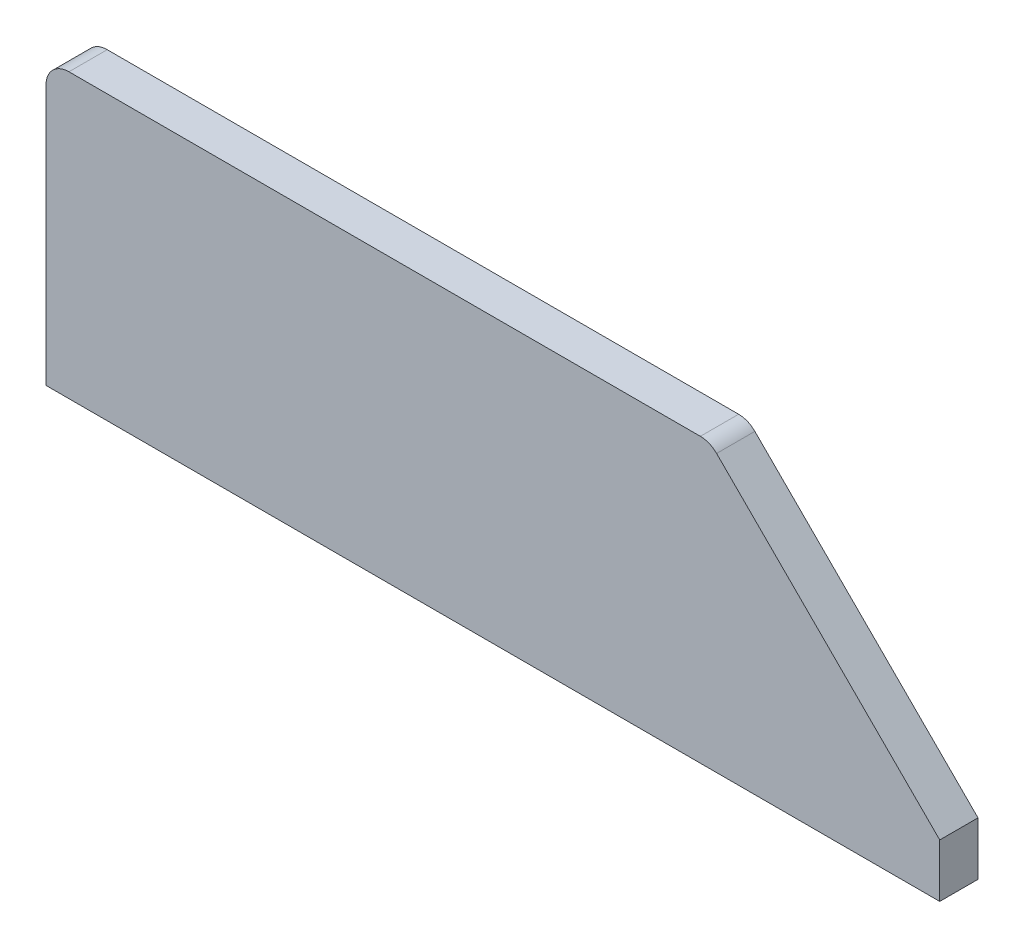
ISO-10303-21;
HEADER;
FILE_DESCRIPTION(('STEP AP214'),'2;1');
FILE_NAME('part.step','',(''),(''),'','','');
FILE_SCHEMA(('AUTOMOTIVE_DESIGN { 1 0 10303 214 1 1 1 1 }'));
ENDSEC;
DATA;
#1=APPLICATION_CONTEXT('core data for automotive mechanical design processes');
#2=APPLICATION_PROTOCOL_DEFINITION('international standard','automotive_design',2000,#1);
#3=PRODUCT_CONTEXT('',#1,'mechanical');
#4=PRODUCT('Part','Part','',(#3));
#5=PRODUCT_RELATED_PRODUCT_CATEGORY('part','',(#4));
#6=PRODUCT_DEFINITION_FORMATION('','',#4);
#7=PRODUCT_DEFINITION_CONTEXT('part definition',#1,'design');
#8=PRODUCT_DEFINITION('design','',#6,#7);
#9=PRODUCT_DEFINITION_SHAPE('','',#8);
#10=(LENGTH_UNIT() NAMED_UNIT(*) SI_UNIT(.MILLI.,.METRE.));
#11=(NAMED_UNIT(*) PLANE_ANGLE_UNIT() SI_UNIT($,.RADIAN.));
#12=(NAMED_UNIT(*) SI_UNIT($,.STERADIAN.) SOLID_ANGLE_UNIT());
#13=UNCERTAINTY_MEASURE_WITH_UNIT(LENGTH_MEASURE(1.E-05),#10,'distance_accuracy_value','');
#14=(GEOMETRIC_REPRESENTATION_CONTEXT(3) GLOBAL_UNCERTAINTY_ASSIGNED_CONTEXT((#13)) GLOBAL_UNIT_ASSIGNED_CONTEXT((#10,
#11,#12)) REPRESENTATION_CONTEXT('',''));
#15=CARTESIAN_POINT('',(0.,0.,0.));
#16=DIRECTION('',(0.,0.,1.));
#17=DIRECTION('',(1.,0.,0.));
#18=AXIS2_PLACEMENT_3D('',#15,#16,#17);
#19=CARTESIAN_POINT('',(85.5147186257616,34.,5.));
#20=DIRECTION('',(0.,0.,-1.));
#21=DIRECTION('',(-1.,0.,0.));
#22=AXIS2_PLACEMENT_3D('',#19,#20,#21);
#23=CYLINDRICAL_SURFACE('',#22,2.99999999999999);
#24=CARTESIAN_POINT('',(85.5147186257616,34.,0.));
#25=DIRECTION('',(0.,0.,1.));
#26=DIRECTION('',(1.,0.,0.));
#27=AXIS2_PLACEMENT_3D('',#24,#25,#26);
#28=CIRCLE('',#27,2.99999999999999);
#29=CARTESIAN_POINT('',(87.6360389693212,36.1213203435597,0.));
#30=VERTEX_POINT('',#29);
#31=CARTESIAN_POINT('',(85.5147186257616,37.,0.));
#32=VERTEX_POINT('',#31);
#33=EDGE_CURVE('E123',#30,#32,#28,.T.);
#34=ORIENTED_EDGE('',*,*,#33,.T.);
#35=DIRECTION('',(0.,0.,-1.));
#36=VECTOR('',#35,1.);
#37=CARTESIAN_POINT('',(85.5147186257616,37.,5.));
#38=LINE('',#37,#36);
#39=CARTESIAN_POINT('',(85.5147186257616,37.,5.));
#40=VERTEX_POINT('',#39);
#41=EDGE_CURVE('E11',#40,#32,#38,.T.);
#42=ORIENTED_EDGE('',*,*,#41,.F.);
#43=CARTESIAN_POINT('',(85.5147186257616,34.,5.));
#44=DIRECTION('',(0.,0.,1.));
#45=DIRECTION('',(1.,0.,0.));
#46=AXIS2_PLACEMENT_3D('',#43,#44,#45);
#47=CIRCLE('',#46,2.99999999999999);
#48=CARTESIAN_POINT('',(87.6360389693212,36.1213203435597,5.));
#49=VERTEX_POINT('',#48);
#50=EDGE_CURVE('E135',#49,#40,#47,.T.);
#51=ORIENTED_EDGE('',*,*,#50,.F.);
#52=DIRECTION('',(0.,0.,-1.));
#53=VECTOR('',#52,1.);
#54=CARTESIAN_POINT('',(87.6360389693212,36.1213203435597,5.));
#55=LINE('',#54,#53);
#56=EDGE_CURVE('E119',#49,#30,#55,.T.);
#57=ORIENTED_EDGE('',*,*,#56,.T.);
#58=EDGE_LOOP('',(#34,#42,#51,#57));
#59=FACE_BOUND('',#58,.T.);
#60=ADVANCED_FACE('F33',(#59),#23,.T.);
#61=CARTESIAN_POINT('',(3.00000000000012,37.,5.));
#62=DIRECTION('',(0.,-1.,0.));
#63=DIRECTION('',(1.,0.,0.));
#64=AXIS2_PLACEMENT_3D('',#61,#62,#63);
#65=PLANE('',#64);
#66=DIRECTION('',(-1.,0.,0.));
#67=VECTOR('',#66,1.);
#68=CARTESIAN_POINT('',(3.00000000000012,37.,0.));
#69=LINE('',#68,#67);
#70=CARTESIAN_POINT('',(3.00000000000012,37.,0.));
#71=VERTEX_POINT('',#70);
#72=EDGE_CURVE('E126',#32,#71,#69,.T.);
#73=ORIENTED_EDGE('',*,*,#72,.T.);
#74=DIRECTION('',(0.,0.,-1.));
#75=VECTOR('',#74,1.);
#76=CARTESIAN_POINT('',(3.00000000000012,37.,5.));
#77=LINE('',#76,#75);
#78=CARTESIAN_POINT('',(3.00000000000012,37.,5.));
#79=VERTEX_POINT('',#78);
#80=EDGE_CURVE('E41',#79,#71,#77,.T.);
#81=ORIENTED_EDGE('',*,*,#80,.F.);
#82=DIRECTION('',(-1.,0.,0.));
#83=VECTOR('',#82,1.);
#84=CARTESIAN_POINT('',(3.00000000000012,37.,5.));
#85=LINE('',#84,#83);
#86=EDGE_CURVE('E89',#40,#79,#85,.T.);
#87=ORIENTED_EDGE('',*,*,#86,.F.);
#88=ORIENTED_EDGE('',*,*,#41,.T.);
#89=EDGE_LOOP('',(#73,#81,#87,#88));
#90=FACE_BOUND('',#89,.T.);
#91=ADVANCED_FACE('F160',(#90),#65,.F.);
#92=CARTESIAN_POINT('',(3.00000000000012,34.,5.));
#93=DIRECTION('',(0.,0.,-1.));
#94=DIRECTION('',(-1.,0.,0.));
#95=AXIS2_PLACEMENT_3D('',#92,#93,#94);
#96=CYLINDRICAL_SURFACE('',#95,3.);
#97=CARTESIAN_POINT('',(3.00000000000012,34.,0.));
#98=DIRECTION('',(0.,0.,1.));
#99=DIRECTION('',(1.,0.,0.));
#100=AXIS2_PLACEMENT_3D('',#97,#98,#99);
#101=CIRCLE('',#100,3.);
#102=CARTESIAN_POINT('',(1.17961196366423E-13,34.,0.));
#103=VERTEX_POINT('',#102);
#104=EDGE_CURVE('E128',#71,#103,#101,.T.);
#105=ORIENTED_EDGE('',*,*,#104,.T.);
#106=DIRECTION('',(0.,0.,-1.));
#107=VECTOR('',#106,1.);
#108=CARTESIAN_POINT('',(1.17961196366423E-13,34.,5.));
#109=LINE('',#108,#107);
#110=CARTESIAN_POINT('',(1.17961196366423E-13,34.,5.));
#111=VERTEX_POINT('',#110);
#112=EDGE_CURVE('E139',#111,#103,#109,.T.);
#113=ORIENTED_EDGE('',*,*,#112,.F.);
#114=CARTESIAN_POINT('',(3.00000000000012,34.,5.));
#115=DIRECTION('',(0.,0.,1.));
#116=DIRECTION('',(1.,0.,0.));
#117=AXIS2_PLACEMENT_3D('',#114,#115,#116);
#118=CIRCLE('',#117,3.);
#119=EDGE_CURVE('E147',#79,#111,#118,.T.);
#120=ORIENTED_EDGE('',*,*,#119,.F.);
#121=ORIENTED_EDGE('',*,*,#80,.T.);
#122=EDGE_LOOP('',(#105,#113,#120,#121));
#123=FACE_BOUND('',#122,.T.);
#124=ADVANCED_FACE('F145',(#123),#96,.T.);
#125=CARTESIAN_POINT('',(0.,0.,5.));
#126=DIRECTION('',(1.,0.,0.));
#127=DIRECTION('',(0.,1.,0.));
#128=AXIS2_PLACEMENT_3D('',#125,#126,#127);
#129=PLANE('',#128);
#130=DIRECTION('',(0.,-1.,0.));
#131=VECTOR('',#130,1.);
#132=CARTESIAN_POINT('',(0.,0.,0.));
#133=LINE('',#132,#131);
#134=CARTESIAN_POINT('',(0.,0.,0.));
#135=VERTEX_POINT('',#134);
#136=EDGE_CURVE('E130',#103,#135,#133,.T.);
#137=ORIENTED_EDGE('',*,*,#136,.T.);
#138=DIRECTION('',(0.,0.,-1.));
#139=VECTOR('',#138,1.);
#140=CARTESIAN_POINT('',(0.,0.,5.));
#141=LINE('',#140,#139);
#142=CARTESIAN_POINT('',(0.,0.,5.));
#143=VERTEX_POINT('',#142);
#144=EDGE_CURVE('E114',#143,#135,#141,.T.);
#145=ORIENTED_EDGE('',*,*,#144,.F.);
#146=DIRECTION('',(0.,-1.,0.));
#147=VECTOR('',#146,1.);
#148=CARTESIAN_POINT('',(0.,0.,5.));
#149=LINE('',#148,#147);
#150=EDGE_CURVE('E105',#111,#143,#149,.T.);
#151=ORIENTED_EDGE('',*,*,#150,.F.);
#152=ORIENTED_EDGE('',*,*,#112,.T.);
#153=EDGE_LOOP('',(#137,#145,#151,#152));
#154=FACE_BOUND('',#153,.T.);
#155=ADVANCED_FACE('F153',(#154),#129,.F.);
#156=CARTESIAN_POINT('',(0.,0.,5.));
#157=DIRECTION('',(0.,1.,0.));
#158=DIRECTION('',(0.,0.,1.));
#159=AXIS2_PLACEMENT_3D('',#156,#157,#158);
#160=PLANE('',#159);
#161=DIRECTION('',(1.,0.,0.));
#162=VECTOR('',#161,1.);
#163=CARTESIAN_POINT('',(0.,0.,0.));
#164=LINE('',#163,#162);
#165=CARTESIAN_POINT('',(116.79668369298,0.,0.));
#166=VERTEX_POINT('',#165);
#167=EDGE_CURVE('E113',#135,#166,#164,.T.);
#168=ORIENTED_EDGE('',*,*,#167,.T.);
#169=DIRECTION('',(0.,0.,-1.));
#170=VECTOR('',#169,1.);
#171=CARTESIAN_POINT('',(116.79668369298,0.,5.));
#172=LINE('',#171,#170);
#173=CARTESIAN_POINT('',(116.79668369298,0.,5.));
#174=VERTEX_POINT('',#173);
#175=EDGE_CURVE('E110',#174,#166,#172,.T.);
#176=ORIENTED_EDGE('',*,*,#175,.F.);
#177=DIRECTION('',(1.,0.,0.));
#178=VECTOR('',#177,1.);
#179=CARTESIAN_POINT('',(0.,0.,5.));
#180=LINE('',#179,#178);
#181=EDGE_CURVE('E99',#143,#174,#180,.T.);
#182=ORIENTED_EDGE('',*,*,#181,.F.);
#183=ORIENTED_EDGE('',*,*,#144,.T.);
#184=EDGE_LOOP('',(#168,#176,#182,#183));
#185=FACE_BOUND('',#184,.T.);
#186=ADVANCED_FACE('F111',(#185),#160,.F.);
#187=CARTESIAN_POINT('',(116.79668369298,0.,5.));
#188=DIRECTION('',(-1.,0.,0.));
#189=DIRECTION('',(0.,0.,1.));
#190=AXIS2_PLACEMENT_3D('',#187,#188,#189);
#191=PLANE('',#190);
#192=DIRECTION('',(0.,1.,0.));
#193=VECTOR('',#192,1.);
#194=CARTESIAN_POINT('',(116.79668369298,0.,0.));
#195=LINE('',#194,#193);
#196=CARTESIAN_POINT('',(116.79668369298,6.96067561990135,0.));
#197=VERTEX_POINT('',#196);
#198=EDGE_CURVE('E75',#166,#197,#195,.T.);
#199=ORIENTED_EDGE('',*,*,#198,.T.);
#200=DIRECTION('',(0.,0.,-1.));
#201=VECTOR('',#200,1.);
#202=CARTESIAN_POINT('',(116.79668369298,6.96067561990135,5.));
#203=LINE('',#202,#201);
#204=CARTESIAN_POINT('',(116.79668369298,6.96067561990135,5.));
#205=VERTEX_POINT('',#204);
#206=EDGE_CURVE('E115',#205,#197,#203,.T.);
#207=ORIENTED_EDGE('',*,*,#206,.F.);
#208=DIRECTION('',(0.,1.,0.));
#209=VECTOR('',#208,1.);
#210=CARTESIAN_POINT('',(116.79668369298,0.,5.));
#211=LINE('',#210,#209);
#212=EDGE_CURVE('E103',#174,#205,#211,.T.);
#213=ORIENTED_EDGE('',*,*,#212,.F.);
#214=ORIENTED_EDGE('',*,*,#175,.T.);
#215=EDGE_LOOP('',(#199,#207,#213,#214));
#216=FACE_BOUND('',#215,.T.);
#217=ADVANCED_FACE('F117',(#216),#191,.F.);
#218=CARTESIAN_POINT('',(87.6360389693212,36.1213203435597,5.));
#219=DIRECTION('',(-0.707106781186544,-0.707106781186551,0.));
#220=DIRECTION('',(0.707106781186551,-0.707106781186544,0.));
#221=AXIS2_PLACEMENT_3D('',#218,#219,#220);
#222=PLANE('',#221);
#223=DIRECTION('',(-0.707106781186551,0.707106781186544,0.));
#224=VECTOR('',#223,1.);
#225=CARTESIAN_POINT('',(87.6360389693212,36.1213203435597,0.));
#226=LINE('',#225,#224);
#227=EDGE_CURVE('E81',#197,#30,#226,.T.);
#228=ORIENTED_EDGE('',*,*,#227,.T.);
#229=ORIENTED_EDGE('',*,*,#56,.F.);
#230=DIRECTION('',(-0.707106781186551,0.707106781186544,0.));
#231=VECTOR('',#230,1.);
#232=CARTESIAN_POINT('',(87.6360389693212,36.1213203435597,5.));
#233=LINE('',#232,#231);
#234=EDGE_CURVE('E49',#205,#49,#233,.T.);
#235=ORIENTED_EDGE('',*,*,#234,.F.);
#236=ORIENTED_EDGE('',*,*,#206,.T.);
#237=EDGE_LOOP('',(#228,#229,#235,#236));
#238=FACE_BOUND('',#237,.T.);
#239=ADVANCED_FACE('F174',(#238),#222,.F.);
#240=CARTESIAN_POINT('',(85.5147186257616,34.,5.));
#241=DIRECTION('',(0.,0.,1.));
#242=DIRECTION('',(1.,0.,0.));
#243=AXIS2_PLACEMENT_3D('',#240,#241,#242);
#244=PLANE('',#243);
#245=ORIENTED_EDGE('',*,*,#50,.T.);
#246=ORIENTED_EDGE('',*,*,#86,.T.);
#247=ORIENTED_EDGE('',*,*,#119,.T.);
#248=ORIENTED_EDGE('',*,*,#150,.T.);
#249=ORIENTED_EDGE('',*,*,#181,.T.);
#250=ORIENTED_EDGE('',*,*,#212,.T.);
#251=ORIENTED_EDGE('',*,*,#234,.T.);
#252=EDGE_LOOP('',(#245,#246,#247,#248,#249,#250,#251));
#253=FACE_BOUND('',#252,.T.);
#254=ADVANCED_FACE('F101',(#253),#244,.T.);
#255=CARTESIAN_POINT('',(85.5147186257616,34.,0.));
#256=DIRECTION('',(0.,0.,1.));
#257=DIRECTION('',(1.,0.,0.));
#258=AXIS2_PLACEMENT_3D('',#255,#256,#257);
#259=PLANE('',#258);
#260=ORIENTED_EDGE('',*,*,#33,.F.);
#261=ORIENTED_EDGE('',*,*,#227,.F.);
#262=ORIENTED_EDGE('',*,*,#198,.F.);
#263=ORIENTED_EDGE('',*,*,#167,.F.);
#264=ORIENTED_EDGE('',*,*,#136,.F.);
#265=ORIENTED_EDGE('',*,*,#104,.F.);
#266=ORIENTED_EDGE('',*,*,#72,.F.);
#267=EDGE_LOOP('',(#260,#261,#262,#263,#264,#265,#266));
#268=FACE_BOUND('',#267,.T.);
#269=ADVANCED_FACE('F151',(#268),#259,.F.);
#270=CLOSED_SHELL('',(#60,#91,#124,#155,#186,#217,#239,#254,#269));
#271=MANIFOLD_SOLID_BREP('B2',#270);
#272=ADVANCED_BREP_SHAPE_REPRESENTATION('',(#18,#271),#14);
#273=SHAPE_DEFINITION_REPRESENTATION(#9,#272);
ENDSEC;
END-ISO-10303-21;
